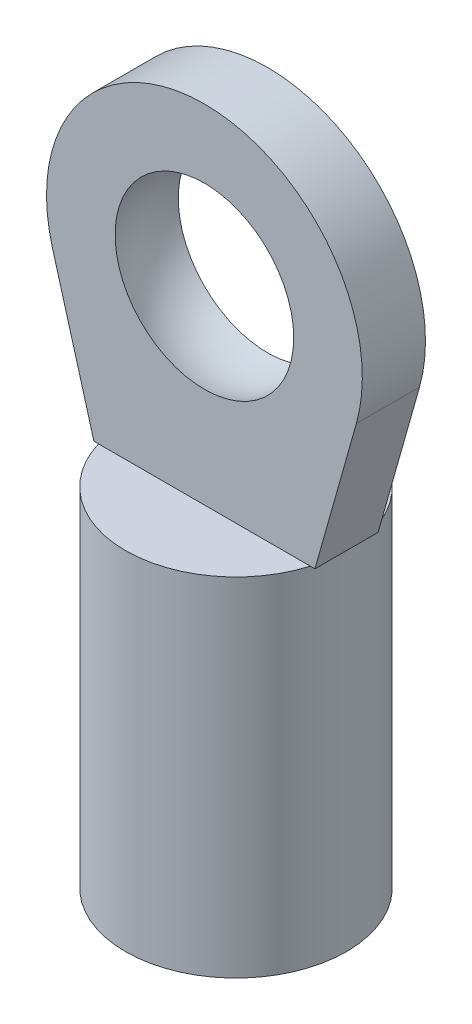
ISO-10303-21;
HEADER;
FILE_DESCRIPTION(('STEP AP214'),'2;1');
FILE_NAME('part.step','',(''),(''),'','','');
FILE_SCHEMA(('AUTOMOTIVE_DESIGN { 1 0 10303 214 1 1 1 1 }'));
ENDSEC;
DATA;
#1=APPLICATION_CONTEXT('core data for automotive mechanical design processes');
#2=APPLICATION_PROTOCOL_DEFINITION('international standard','automotive_design',2000,#1);
#3=PRODUCT_CONTEXT('',#1,'mechanical');
#4=PRODUCT('Part','Part','',(#3));
#5=PRODUCT_RELATED_PRODUCT_CATEGORY('part','',(#4));
#6=PRODUCT_DEFINITION_FORMATION('','',#4);
#7=PRODUCT_DEFINITION_CONTEXT('part definition',#1,'design');
#8=PRODUCT_DEFINITION('design','',#6,#7);
#9=PRODUCT_DEFINITION_SHAPE('','',#8);
#10=(LENGTH_UNIT() NAMED_UNIT(*) SI_UNIT(.MILLI.,.METRE.));
#11=(NAMED_UNIT(*) PLANE_ANGLE_UNIT() SI_UNIT($,.RADIAN.));
#12=(NAMED_UNIT(*) SI_UNIT($,.STERADIAN.) SOLID_ANGLE_UNIT());
#13=UNCERTAINTY_MEASURE_WITH_UNIT(LENGTH_MEASURE(1.E-05),#10,'distance_accuracy_value','');
#14=(GEOMETRIC_REPRESENTATION_CONTEXT(3) GLOBAL_UNCERTAINTY_ASSIGNED_CONTEXT((#13)) GLOBAL_UNIT_ASSIGNED_CONTEXT((#10,
#11,#12)) REPRESENTATION_CONTEXT('',''));
#15=CARTESIAN_POINT('',(0.,0.,0.));
#16=DIRECTION('',(0.,0.,1.));
#17=DIRECTION('',(1.,0.,0.));
#18=AXIS2_PLACEMENT_3D('',#15,#16,#17);
#19=CARTESIAN_POINT('',(0.,17.,-1.));
#20=DIRECTION('',(0.,0.,1.));
#21=DIRECTION('',(1.,0.,0.));
#22=AXIS2_PLACEMENT_3D('',#19,#20,#21);
#23=PLANE('',#22);
#24=CARTESIAN_POINT('',(0.,17.,-1.));
#25=DIRECTION('',(0.,0.,1.));
#26=DIRECTION('',(1.,0.,0.));
#27=AXIS2_PLACEMENT_3D('',#24,#25,#26);
#28=CIRCLE('',#27,5.);
#29=CARTESIAN_POINT('',(4.81149764590455,15.6400402934443,-1.));
#30=VERTEX_POINT('',#29);
#31=CARTESIAN_POINT('',(-4.81149764590455,15.6400402934443,-1.));
#32=VERTEX_POINT('',#31);
#33=EDGE_CURVE('E101',#30,#32,#28,.T.);
#34=ORIENTED_EDGE('',*,*,#33,.F.);
#35=DIRECTION('',(0.271991941311136,0.962299529180909,0.));
#36=VECTOR('',#35,1.);
#37=CARTESIAN_POINT('',(3.5,11.,-1.));
#38=LINE('',#37,#36);
#39=CARTESIAN_POINT('',(3.5,11.,-1.));
#40=VERTEX_POINT('',#39);
#41=EDGE_CURVE('E106',#40,#30,#38,.T.);
#42=ORIENTED_EDGE('',*,*,#41,.F.);
#43=DIRECTION('',(1.,0.,0.));
#44=VECTOR('',#43,1.);
#45=CARTESIAN_POINT('',(-3.5,11.,-1.));
#46=LINE('',#45,#44);
#47=CARTESIAN_POINT('',(3.35410196624968,11.,-1.));
#48=VERTEX_POINT('',#47);
#49=EDGE_CURVE('E52',#48,#40,#46,.T.);
#50=ORIENTED_EDGE('',*,*,#49,.F.);
#51=CARTESIAN_POINT('',(-3.35410196624968,11.,-1.));
#52=VERTEX_POINT('',#51);
#53=EDGE_CURVE('E42',#52,#48,#46,.T.);
#54=ORIENTED_EDGE('',*,*,#53,.F.);
#55=CARTESIAN_POINT('',(-3.5,11.,-1.));
#56=VERTEX_POINT('',#55);
#57=EDGE_CURVE('E131',#56,#52,#46,.T.);
#58=ORIENTED_EDGE('',*,*,#57,.F.);
#59=DIRECTION('',(0.271991941311136,-0.962299529180909,0.));
#60=VECTOR('',#59,1.);
#61=CARTESIAN_POINT('',(-4.81149764590455,15.6400402934443,-1.));
#62=LINE('',#61,#60);
#63=EDGE_CURVE('E129',#32,#56,#62,.T.);
#64=ORIENTED_EDGE('',*,*,#63,.F.);
#65=EDGE_LOOP('',(#34,#42,#50,#54,#58,#64));
#66=FACE_BOUND('',#65,.T.);
#67=CARTESIAN_POINT('',(0.,17.,-1.));
#68=DIRECTION('',(0.,0.,1.));
#69=DIRECTION('',(1.,0.,0.));
#70=AXIS2_PLACEMENT_3D('',#67,#68,#69);
#71=CIRCLE('',#70,2.82842712474619);
#72=CARTESIAN_POINT('',(2.82842712474619,17.,-1.));
#73=VERTEX_POINT('',#72);
#74=EDGE_CURVE('E122',#73,#73,#71,.F.);
#75=ORIENTED_EDGE('',*,*,#74,.F.);
#76=EDGE_LOOP('',(#75));
#77=FACE_BOUND('',#76,.T.);
#78=ADVANCED_FACE('F33',(#66,#77),#23,.F.);
#79=CARTESIAN_POINT('',(0.,17.,1.));
#80=DIRECTION('',(0.,0.,1.));
#81=DIRECTION('',(1.,0.,0.));
#82=AXIS2_PLACEMENT_3D('',#79,#80,#81);
#83=PLANE('',#82);
#84=CARTESIAN_POINT('',(0.,17.,1.));
#85=DIRECTION('',(0.,0.,1.));
#86=DIRECTION('',(1.,0.,0.));
#87=AXIS2_PLACEMENT_3D('',#84,#85,#86);
#88=CIRCLE('',#87,5.);
#89=CARTESIAN_POINT('',(4.81149764590455,15.6400402934443,1.));
#90=VERTEX_POINT('',#89);
#91=CARTESIAN_POINT('',(-4.81149764590455,15.6400402934443,1.));
#92=VERTEX_POINT('',#91);
#93=EDGE_CURVE('E99',#90,#92,#88,.T.);
#94=ORIENTED_EDGE('',*,*,#93,.T.);
#95=DIRECTION('',(0.271991941311136,-0.962299529180909,0.));
#96=VECTOR('',#95,1.);
#97=CARTESIAN_POINT('',(-4.81149764590455,15.6400402934443,1.));
#98=LINE('',#97,#96);
#99=CARTESIAN_POINT('',(-3.5,11.,1.));
#100=VERTEX_POINT('',#99);
#101=EDGE_CURVE('E109',#92,#100,#98,.T.);
#102=ORIENTED_EDGE('',*,*,#101,.T.);
#103=DIRECTION('',(1.,0.,0.));
#104=VECTOR('',#103,1.);
#105=CARTESIAN_POINT('',(-3.5,11.,1.));
#106=LINE('',#105,#104);
#107=CARTESIAN_POINT('',(-3.35410196624968,11.,1.));
#108=VERTEX_POINT('',#107);
#109=EDGE_CURVE('E44',#100,#108,#106,.T.);
#110=ORIENTED_EDGE('',*,*,#109,.T.);
#111=CARTESIAN_POINT('',(3.35410196624968,11.,1.));
#112=VERTEX_POINT('',#111);
#113=EDGE_CURVE('E11',#108,#112,#106,.T.);
#114=ORIENTED_EDGE('',*,*,#113,.T.);
#115=CARTESIAN_POINT('',(3.5,11.,1.));
#116=VERTEX_POINT('',#115);
#117=EDGE_CURVE('E45',#112,#116,#106,.T.);
#118=ORIENTED_EDGE('',*,*,#117,.T.);
#119=DIRECTION('',(0.271991941311136,0.962299529180909,0.));
#120=VECTOR('',#119,1.);
#121=CARTESIAN_POINT('',(3.5,11.,1.));
#122=LINE('',#121,#120);
#123=EDGE_CURVE('E121',#116,#90,#122,.T.);
#124=ORIENTED_EDGE('',*,*,#123,.T.);
#125=EDGE_LOOP('',(#94,#102,#110,#114,#118,#124));
#126=FACE_BOUND('',#125,.T.);
#127=CARTESIAN_POINT('',(0.,17.,1.));
#128=DIRECTION('',(0.,0.,1.));
#129=DIRECTION('',(1.,0.,0.));
#130=AXIS2_PLACEMENT_3D('',#127,#128,#129);
#131=CIRCLE('',#130,2.82842712474619);
#132=CARTESIAN_POINT('',(2.82842712474619,17.,1.));
#133=VERTEX_POINT('',#132);
#134=EDGE_CURVE('E37',#133,#133,#131,.F.);
#135=ORIENTED_EDGE('',*,*,#134,.T.);
#136=EDGE_LOOP('',(#135));
#137=FACE_BOUND('',#136,.T.);
#138=ADVANCED_FACE('F118',(#126,#137),#83,.T.);
#139=CARTESIAN_POINT('',(0.,11.,0.));
#140=DIRECTION('',(0.,1.,0.));
#141=DIRECTION('',(0.,0.,1.));
#142=AXIS2_PLACEMENT_3D('',#139,#140,#141);
#143=PLANE('',#142);
#144=CARTESIAN_POINT('',(0.,11.,0.));
#145=DIRECTION('',(0.,1.,0.));
#146=DIRECTION('',(0.,0.,1.));
#147=AXIS2_PLACEMENT_3D('',#144,#145,#146);
#148=CIRCLE('',#147,3.5);
#149=EDGE_CURVE('E178',#48,#52,#148,.T.);
#150=ORIENTED_EDGE('',*,*,#149,.T.);
#151=ORIENTED_EDGE('',*,*,#53,.T.);
#152=EDGE_LOOP('',(#150,#151));
#153=FACE_BOUND('',#152,.T.);
#154=ADVANCED_FACE('F202',(#153),#143,.T.);
#155=CARTESIAN_POINT('',(0.,0.,0.));
#156=DIRECTION('',(0.,1.,0.));
#157=DIRECTION('',(0.,0.,1.));
#158=AXIS2_PLACEMENT_3D('',#155,#156,#157);
#159=PLANE('',#158);
#160=CARTESIAN_POINT('',(0.,0.,0.));
#161=DIRECTION('',(0.,1.,0.));
#162=DIRECTION('',(0.,0.,1.));
#163=AXIS2_PLACEMENT_3D('',#160,#161,#162);
#164=CIRCLE('',#163,3.5);
#165=CARTESIAN_POINT('',(0.,0.,3.5));
#166=VERTEX_POINT('',#165);
#167=EDGE_CURVE('E152',#166,#166,#164,.T.);
#168=ORIENTED_EDGE('',*,*,#167,.F.);
#169=EDGE_LOOP('',(#168));
#170=FACE_BOUND('',#169,.T.);
#171=CARTESIAN_POINT('',(0.,0.,0.));
#172=DIRECTION('',(0.,1.,0.));
#173=DIRECTION('',(0.,0.,1.));
#174=AXIS2_PLACEMENT_3D('',#171,#172,#173);
#175=CIRCLE('',#174,1.75);
#176=CARTESIAN_POINT('',(0.,0.,1.75));
#177=VERTEX_POINT('',#176);
#178=EDGE_CURVE('E150',#177,#177,#175,.T.);
#179=ORIENTED_EDGE('',*,*,#178,.T.);
#180=EDGE_LOOP('',(#179));
#181=FACE_BOUND('',#180,.T.);
#182=ADVANCED_FACE('F238',(#170,#181),#159,.F.);
#183=CARTESIAN_POINT('',(0.,10.,0.));
#184=DIRECTION('',(0.,-1.,0.));
#185=DIRECTION('',(0.,0.,-1.));
#186=AXIS2_PLACEMENT_3D('',#183,#184,#185);
#187=CYLINDRICAL_SURFACE('',#186,3.5);
#188=ORIENTED_EDGE('',*,*,#167,.T.);
#189=EDGE_LOOP('',(#188));
#190=FACE_BOUND('',#189,.T.);
#191=CARTESIAN_POINT('',(3.5,11.,0.));
#192=VERTEX_POINT('',#191);
#193=EDGE_CURVE('E144',#112,#192,#148,.T.);
#194=ORIENTED_EDGE('',*,*,#193,.F.);
#195=EDGE_CURVE('E137',#108,#112,#148,.T.);
#196=ORIENTED_EDGE('',*,*,#195,.F.);
#197=CARTESIAN_POINT('',(-3.5,11.,0.));
#198=VERTEX_POINT('',#197);
#199=EDGE_CURVE('E173',#198,#108,#148,.T.);
#200=ORIENTED_EDGE('',*,*,#199,.F.);
#201=EDGE_CURVE('E175',#52,#198,#148,.T.);
#202=ORIENTED_EDGE('',*,*,#201,.F.);
#203=ORIENTED_EDGE('',*,*,#149,.F.);
#204=EDGE_CURVE('E147',#192,#48,#148,.T.);
#205=ORIENTED_EDGE('',*,*,#204,.F.);
#206=EDGE_LOOP('',(#194,#196,#200,#202,#203,#205));
#207=FACE_BOUND('',#206,.T.);
#208=ADVANCED_FACE('F35',(#190,#207),#187,.T.);
#209=CARTESIAN_POINT('',(0.,10.,0.));
#210=DIRECTION('',(0.,-1.,0.));
#211=DIRECTION('',(0.,0.,-1.));
#212=AXIS2_PLACEMENT_3D('',#209,#210,#211);
#213=CYLINDRICAL_SURFACE('',#212,1.75);
#214=CARTESIAN_POINT('',(0.,10.,0.));
#215=DIRECTION('',(0.,1.,0.));
#216=DIRECTION('',(0.,0.,1.));
#217=AXIS2_PLACEMENT_3D('',#214,#215,#216);
#218=CIRCLE('',#217,1.75);
#219=CARTESIAN_POINT('',(0.,10.,1.75));
#220=VERTEX_POINT('',#219);
#221=EDGE_CURVE('E146',#220,#220,#218,.T.);
#222=ORIENTED_EDGE('',*,*,#221,.T.);
#223=EDGE_LOOP('',(#222));
#224=FACE_BOUND('',#223,.T.);
#225=ORIENTED_EDGE('',*,*,#178,.F.);
#226=EDGE_LOOP('',(#225));
#227=FACE_BOUND('',#226,.T.);
#228=ADVANCED_FACE('F253',(#224,#227),#213,.F.);
#229=CARTESIAN_POINT('',(0.,10.,0.));
#230=DIRECTION('',(0.,1.,0.));
#231=DIRECTION('',(0.,0.,1.));
#232=AXIS2_PLACEMENT_3D('',#229,#230,#231);
#233=PLANE('',#232);
#234=ORIENTED_EDGE('',*,*,#221,.F.);
#235=EDGE_LOOP('',(#234));
#236=FACE_BOUND('',#235,.T.);
#237=ADVANCED_FACE('F259',(#236),#233,.F.);
#238=ORIENTED_EDGE('',*,*,#113,.F.);
#239=ORIENTED_EDGE('',*,*,#195,.T.);
#240=EDGE_LOOP('',(#238,#239));
#241=FACE_BOUND('',#240,.T.);
#242=ADVANCED_FACE('F181',(#241),#143,.T.);
#243=CARTESIAN_POINT('',(-3.5,11.,-1.));
#244=DIRECTION('',(0.,-1.,0.));
#245=DIRECTION('',(0.,0.,-1.));
#246=AXIS2_PLACEMENT_3D('',#243,#244,#245);
#247=PLANE('',#246);
#248=ORIENTED_EDGE('',*,*,#117,.F.);
#249=ORIENTED_EDGE('',*,*,#193,.T.);
#250=DIRECTION('',(0.,0.,1.));
#251=VECTOR('',#250,1.);
#252=CARTESIAN_POINT('',(3.5,11.,-1.));
#253=LINE('',#252,#251);
#254=EDGE_CURVE('E141',#192,#116,#253,.T.);
#255=ORIENTED_EDGE('',*,*,#254,.T.);
#256=EDGE_LOOP('',(#248,#249,#255));
#257=FACE_BOUND('',#256,.T.);
#258=ADVANCED_FACE('F183',(#257),#247,.T.);
#259=EDGE_CURVE('E138',#40,#192,#253,.T.);
#260=ORIENTED_EDGE('',*,*,#259,.T.);
#261=ORIENTED_EDGE('',*,*,#204,.T.);
#262=ORIENTED_EDGE('',*,*,#49,.T.);
#263=EDGE_LOOP('',(#260,#261,#262));
#264=FACE_BOUND('',#263,.T.);
#265=ADVANCED_FACE('F161',(#264),#247,.T.);
#266=ORIENTED_EDGE('',*,*,#57,.T.);
#267=ORIENTED_EDGE('',*,*,#201,.T.);
#268=DIRECTION('',(0.,0.,1.));
#269=VECTOR('',#268,1.);
#270=CARTESIAN_POINT('',(-3.5,11.,-1.));
#271=LINE('',#270,#269);
#272=EDGE_CURVE('E142',#56,#198,#271,.T.);
#273=ORIENTED_EDGE('',*,*,#272,.F.);
#274=EDGE_LOOP('',(#266,#267,#273));
#275=FACE_BOUND('',#274,.T.);
#276=ADVANCED_FACE('F187',(#275),#247,.T.);
#277=CARTESIAN_POINT('',(0.,17.,-1.));
#278=DIRECTION('',(0.,0.,1.));
#279=DIRECTION('',(1.,0.,0.));
#280=AXIS2_PLACEMENT_3D('',#277,#278,#279);
#281=CYLINDRICAL_SURFACE('',#280,5.);
#282=DIRECTION('',(0.,0.,1.));
#283=VECTOR('',#282,1.);
#284=CARTESIAN_POINT('',(-4.81149764590455,15.6400402934443,-1.));
#285=LINE('',#284,#283);
#286=EDGE_CURVE('E95',#32,#92,#285,.T.);
#287=ORIENTED_EDGE('',*,*,#286,.T.);
#288=ORIENTED_EDGE('',*,*,#93,.F.);
#289=DIRECTION('',(0.,0.,1.));
#290=VECTOR('',#289,1.);
#291=CARTESIAN_POINT('',(4.81149764590455,15.6400402934443,-1.));
#292=LINE('',#291,#290);
#293=EDGE_CURVE('E135',#30,#90,#292,.T.);
#294=ORIENTED_EDGE('',*,*,#293,.F.);
#295=ORIENTED_EDGE('',*,*,#33,.T.);
#296=EDGE_LOOP('',(#287,#288,#294,#295));
#297=FACE_BOUND('',#296,.T.);
#298=ADVANCED_FACE('F97',(#297),#281,.T.);
#299=CARTESIAN_POINT('',(3.5,11.,-1.));
#300=DIRECTION('',(0.962299529180909,-0.271991941311136,0.));
#301=DIRECTION('',(0.271991941311136,0.962299529180909,0.));
#302=AXIS2_PLACEMENT_3D('',#299,#300,#301);
#303=PLANE('',#302);
#304=ORIENTED_EDGE('',*,*,#293,.T.);
#305=ORIENTED_EDGE('',*,*,#123,.F.);
#306=ORIENTED_EDGE('',*,*,#254,.F.);
#307=ORIENTED_EDGE('',*,*,#259,.F.);
#308=ORIENTED_EDGE('',*,*,#41,.T.);
#309=EDGE_LOOP('',(#304,#305,#306,#307,#308));
#310=FACE_BOUND('',#309,.T.);
#311=ADVANCED_FACE('F165',(#310),#303,.T.);
#312=EDGE_CURVE('E105',#198,#100,#271,.T.);
#313=ORIENTED_EDGE('',*,*,#312,.F.);
#314=ORIENTED_EDGE('',*,*,#199,.T.);
#315=ORIENTED_EDGE('',*,*,#109,.F.);
#316=EDGE_LOOP('',(#313,#314,#315));
#317=FACE_BOUND('',#316,.T.);
#318=ADVANCED_FACE('F184',(#317),#247,.T.);
#319=CARTESIAN_POINT('',(-4.81149764590455,15.6400402934443,-1.));
#320=DIRECTION('',(-0.962299529180909,-0.271991941311136,0.));
#321=DIRECTION('',(0.271991941311136,-0.962299529180909,0.));
#322=AXIS2_PLACEMENT_3D('',#319,#320,#321);
#323=PLANE('',#322);
#324=ORIENTED_EDGE('',*,*,#272,.T.);
#325=ORIENTED_EDGE('',*,*,#312,.T.);
#326=ORIENTED_EDGE('',*,*,#101,.F.);
#327=ORIENTED_EDGE('',*,*,#286,.F.);
#328=ORIENTED_EDGE('',*,*,#63,.T.);
#329=EDGE_LOOP('',(#324,#325,#326,#327,#328));
#330=FACE_BOUND('',#329,.T.);
#331=ADVANCED_FACE('F111',(#330),#323,.T.);
#332=CARTESIAN_POINT('',(0.,17.,0.));
#333=DIRECTION('',(0.,1.,0.));
#334=DIRECTION('',(1.,0.,0.));
#335=AXIS2_PLACEMENT_3D('',#332,#333,#334);
#336=SPHERICAL_SURFACE('',#335,3.);
#337=CARTESIAN_POINT('',(0.,17.,0.));
#338=DIRECTION('',(0.,0.,1.));
#339=DIRECTION('',(1.,0.,0.));
#340=AXIS2_PLACEMENT_3D('',#337,#338,#339);
#341=SPHERICAL_SURFACE('',#340,3.);
#342=ORIENTED_EDGE('',*,*,#134,.F.);
#343=EDGE_LOOP('',(#342));
#344=FACE_BOUND('',#343,.T.);
#345=ORIENTED_EDGE('',*,*,#74,.T.);
#346=EDGE_LOOP('',(#345));
#347=FACE_BOUND('',#346,.T.);
#348=ADVANCED_FACE('F192',(#344,#347),#341,.F.);
#349=CLOSED_SHELL('',(#78,#138,#154,#182,#208,#228,#237,#242,#258,#265,#276,#298,#311,#318,#331,#348));
#350=MANIFOLD_SOLID_BREP('B2',#349);
#351=ADVANCED_BREP_SHAPE_REPRESENTATION('',(#18,#350),#14);
#352=SHAPE_DEFINITION_REPRESENTATION(#9,#351);
ENDSEC;
END-ISO-10303-21;
